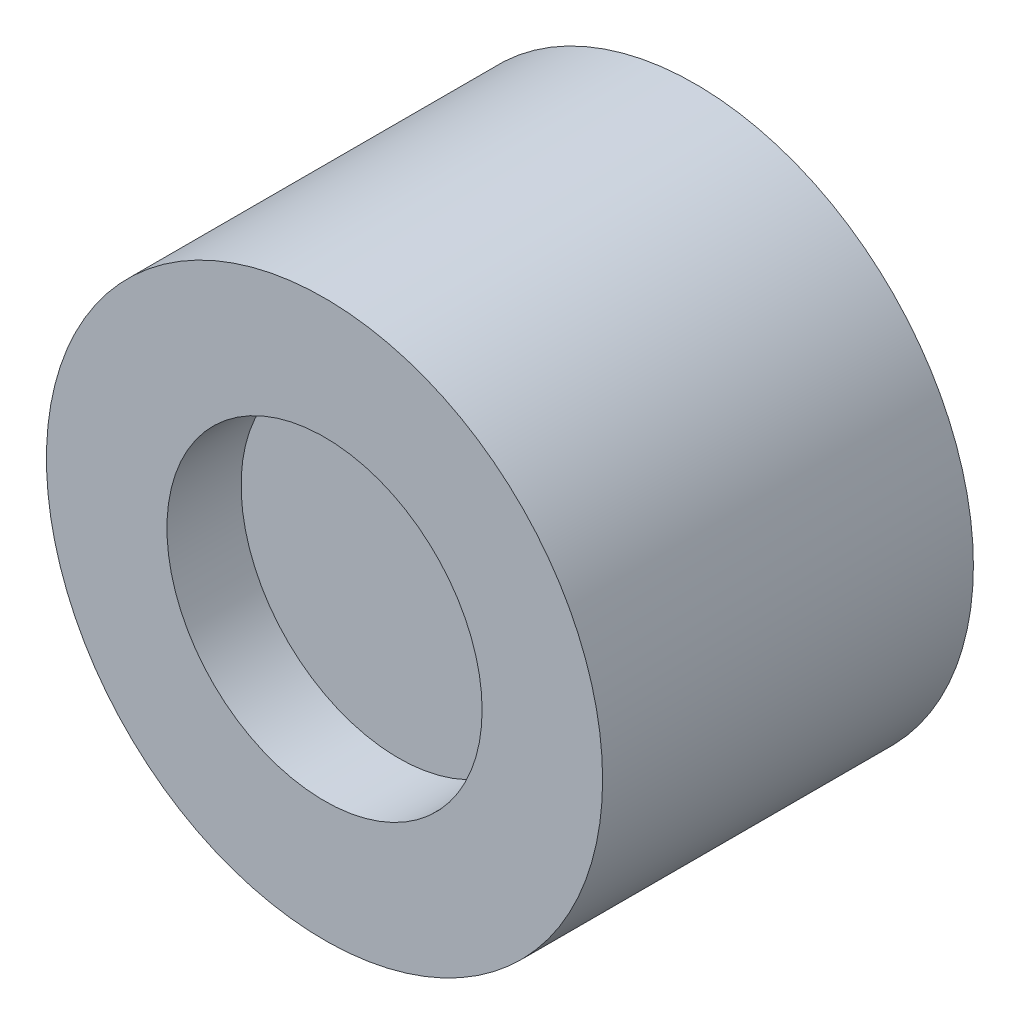
ISO-10303-21;
HEADER;
FILE_DESCRIPTION(('STEP AP214'),'2;1');
FILE_NAME('part.step','',(''),(''),'','','');
FILE_SCHEMA(('AUTOMOTIVE_DESIGN { 1 0 10303 214 1 1 1 1 }'));
ENDSEC;
DATA;
#1=APPLICATION_CONTEXT('core data for automotive mechanical design processes');
#2=APPLICATION_PROTOCOL_DEFINITION('international standard','automotive_design',2000,#1);
#3=PRODUCT_CONTEXT('',#1,'mechanical');
#4=PRODUCT('Part','Part','',(#3));
#5=PRODUCT_RELATED_PRODUCT_CATEGORY('part','',(#4));
#6=PRODUCT_DEFINITION_FORMATION('','',#4);
#7=PRODUCT_DEFINITION_CONTEXT('part definition',#1,'design');
#8=PRODUCT_DEFINITION('design','',#6,#7);
#9=PRODUCT_DEFINITION_SHAPE('','',#8);
#10=(LENGTH_UNIT() NAMED_UNIT(*) SI_UNIT(.MILLI.,.METRE.));
#11=(NAMED_UNIT(*) PLANE_ANGLE_UNIT() SI_UNIT($,.RADIAN.));
#12=(NAMED_UNIT(*) SI_UNIT($,.STERADIAN.) SOLID_ANGLE_UNIT());
#13=UNCERTAINTY_MEASURE_WITH_UNIT(LENGTH_MEASURE(1.E-05),#10,'distance_accuracy_value','');
#14=(GEOMETRIC_REPRESENTATION_CONTEXT(3) GLOBAL_UNCERTAINTY_ASSIGNED_CONTEXT((#13)) GLOBAL_UNIT_ASSIGNED_CONTEXT((#10,
#11,#12)) REPRESENTATION_CONTEXT('',''));
#15=CARTESIAN_POINT('',(0.,0.,0.));
#16=DIRECTION('',(0.,0.,1.));
#17=DIRECTION('',(1.,0.,0.));
#18=AXIS2_PLACEMENT_3D('',#15,#16,#17);
#19=CARTESIAN_POINT('',(0.,0.,10.));
#20=DIRECTION('',(0.,0.,-1.));
#21=DIRECTION('',(-1.,0.,0.));
#22=AXIS2_PLACEMENT_3D('',#19,#20,#21);
#23=CYLINDRICAL_SURFACE('',#22,7.5);
#24=CARTESIAN_POINT('',(0.,0.,10.));
#25=DIRECTION('',(0.,0.,1.));
#26=DIRECTION('',(1.,0.,0.));
#27=AXIS2_PLACEMENT_3D('',#24,#25,#26);
#28=CIRCLE('',#27,7.5);
#29=CARTESIAN_POINT('',(7.5,0.,10.));
#30=VERTEX_POINT('',#29);
#31=EDGE_CURVE('E10',#30,#30,#28,.T.);
#32=ORIENTED_EDGE('',*,*,#31,.F.);
#33=EDGE_LOOP('',(#32));
#34=FACE_BOUND('',#33,.T.);
#35=CARTESIAN_POINT('',(0.,0.,0.));
#36=DIRECTION('',(0.,0.,1.));
#37=DIRECTION('',(1.,0.,0.));
#38=AXIS2_PLACEMENT_3D('',#35,#36,#37);
#39=CIRCLE('',#38,7.5);
#40=CARTESIAN_POINT('',(7.5,0.,0.));
#41=VERTEX_POINT('',#40);
#42=EDGE_CURVE('E44',#41,#41,#39,.T.);
#43=ORIENTED_EDGE('',*,*,#42,.T.);
#44=EDGE_LOOP('',(#43));
#45=FACE_BOUND('',#44,.T.);
#46=ADVANCED_FACE('F41',(#34,#45),#23,.T.);
#47=CARTESIAN_POINT('',(0.,0.,10.));
#48=DIRECTION('',(0.,0.,1.));
#49=DIRECTION('',(1.,0.,0.));
#50=AXIS2_PLACEMENT_3D('',#47,#48,#49);
#51=PLANE('',#50);
#52=CARTESIAN_POINT('',(0.,0.,10.));
#53=DIRECTION('',(0.,0.,1.));
#54=DIRECTION('',(1.,0.,0.));
#55=AXIS2_PLACEMENT_3D('',#52,#53,#54);
#56=CIRCLE('',#55,4.25);
#57=CARTESIAN_POINT('',(4.25,0.,10.));
#58=VERTEX_POINT('',#57);
#59=EDGE_CURVE('E55',#58,#58,#56,.T.);
#60=ORIENTED_EDGE('',*,*,#59,.F.);
#61=EDGE_LOOP('',(#60));
#62=FACE_BOUND('',#61,.T.);
#63=ORIENTED_EDGE('',*,*,#31,.T.);
#64=EDGE_LOOP('',(#63));
#65=FACE_BOUND('',#64,.T.);
#66=ADVANCED_FACE('F72',(#62,#65),#51,.T.);
#67=CARTESIAN_POINT('',(0.,0.,0.));
#68=DIRECTION('',(0.,0.,1.));
#69=DIRECTION('',(1.,0.,0.));
#70=AXIS2_PLACEMENT_3D('',#67,#68,#69);
#71=PLANE('',#70);
#72=ORIENTED_EDGE('',*,*,#42,.F.);
#73=EDGE_LOOP('',(#72));
#74=FACE_BOUND('',#73,.T.);
#75=ADVANCED_FACE('F68',(#74),#71,.F.);
#76=CARTESIAN_POINT('',(0.,0.,8.));
#77=DIRECTION('',(0.,0.,1.));
#78=DIRECTION('',(1.,0.,0.));
#79=AXIS2_PLACEMENT_3D('',#76,#77,#78);
#80=CYLINDRICAL_SURFACE('',#79,4.25);
#81=CARTESIAN_POINT('',(0.,0.,8.));
#82=DIRECTION('',(0.,0.,1.));
#83=DIRECTION('',(1.,0.,0.));
#84=AXIS2_PLACEMENT_3D('',#81,#82,#83);
#85=CIRCLE('',#84,4.25);
#86=CARTESIAN_POINT('',(4.25,0.,8.));
#87=VERTEX_POINT('',#86);
#88=EDGE_CURVE('E53',#87,#87,#85,.T.);
#89=ORIENTED_EDGE('',*,*,#88,.F.);
#90=EDGE_LOOP('',(#89));
#91=FACE_BOUND('',#90,.T.);
#92=ORIENTED_EDGE('',*,*,#59,.T.);
#93=EDGE_LOOP('',(#92));
#94=FACE_BOUND('',#93,.T.);
#95=ADVANCED_FACE('F65',(#91,#94),#80,.F.);
#96=CARTESIAN_POINT('',(0.,0.,8.));
#97=DIRECTION('',(0.,0.,1.));
#98=DIRECTION('',(1.,0.,0.));
#99=AXIS2_PLACEMENT_3D('',#96,#97,#98);
#100=PLANE('',#99);
#101=ORIENTED_EDGE('',*,*,#88,.T.);
#102=EDGE_LOOP('',(#101));
#103=FACE_BOUND('',#102,.T.);
#104=ADVANCED_FACE('F63',(#103),#100,.T.);
#105=CLOSED_SHELL('',(#46,#66,#75,#95,#104));
#106=MANIFOLD_SOLID_BREP('B2',#105);
#107=ADVANCED_BREP_SHAPE_REPRESENTATION('',(#18,#106),#14);
#108=SHAPE_DEFINITION_REPRESENTATION(#9,#107);
ENDSEC;
END-ISO-10303-21;
